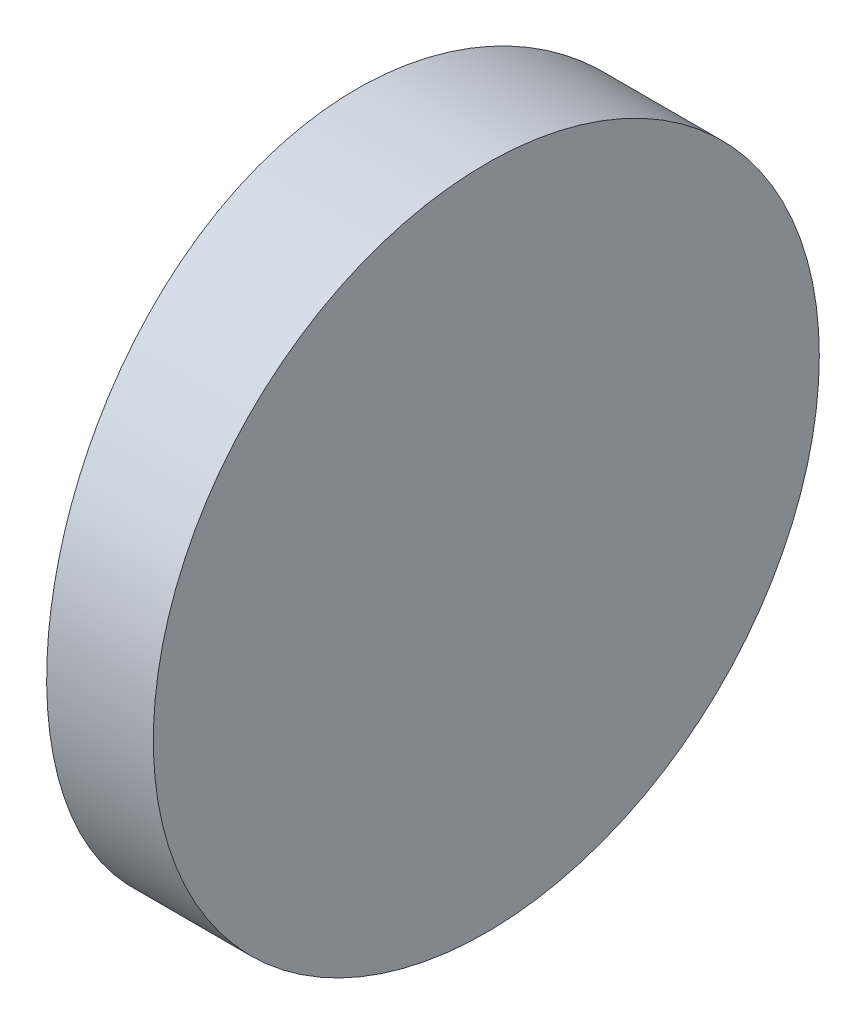
ISO-10303-21;
HEADER;
FILE_DESCRIPTION(('STEP AP214'),'2;1');
FILE_NAME('part.step','',(''),(''),'','','');
FILE_SCHEMA(('AUTOMOTIVE_DESIGN { 1 0 10303 214 1 1 1 1 }'));
ENDSEC;
DATA;
#1=APPLICATION_CONTEXT('core data for automotive mechanical design processes');
#2=APPLICATION_PROTOCOL_DEFINITION('international standard','automotive_design',2000,#1);
#3=PRODUCT_CONTEXT('',#1,'mechanical');
#4=PRODUCT('Part','Part','',(#3));
#5=PRODUCT_RELATED_PRODUCT_CATEGORY('part','',(#4));
#6=PRODUCT_DEFINITION_FORMATION('','',#4);
#7=PRODUCT_DEFINITION_CONTEXT('part definition',#1,'design');
#8=PRODUCT_DEFINITION('design','',#6,#7);
#9=PRODUCT_DEFINITION_SHAPE('','',#8);
#10=(LENGTH_UNIT() NAMED_UNIT(*) SI_UNIT(.MILLI.,.METRE.));
#11=(NAMED_UNIT(*) PLANE_ANGLE_UNIT() SI_UNIT($,.RADIAN.));
#12=(NAMED_UNIT(*) SI_UNIT($,.STERADIAN.) SOLID_ANGLE_UNIT());
#13=UNCERTAINTY_MEASURE_WITH_UNIT(LENGTH_MEASURE(1.E-05),#10,'distance_accuracy_value','');
#14=(GEOMETRIC_REPRESENTATION_CONTEXT(3) GLOBAL_UNCERTAINTY_ASSIGNED_CONTEXT((#13)) GLOBAL_UNIT_ASSIGNED_CONTEXT((#10,
#11,#12)) REPRESENTATION_CONTEXT('',''));
#15=CARTESIAN_POINT('',(0.,0.,0.));
#16=DIRECTION('',(0.,0.,1.));
#17=DIRECTION('',(1.,0.,0.));
#18=AXIS2_PLACEMENT_3D('',#15,#16,#17);
#19=CARTESIAN_POINT('',(4.35520433485127,12.5,0.));
#20=DIRECTION('',(0.,-1.,0.));
#21=DIRECTION('',(0.,0.,-1.));
#22=AXIS2_PLACEMENT_3D('',#19,#20,#21);
#23=CYLINDRICAL_SURFACE('',#22,45.85);
#24=CARTESIAN_POINT('',(-41.4947956651487,0.,0.));
#25=CARTESIAN_POINT('',(-41.494796367303,-1.93674694272046E-06,-0.1747178727447));
#26=CARTESIAN_POINT('',(-41.4937950063209,0.00732904198994089,-0.349407224060694));
#27=CARTESIAN_POINT('',(-41.4898189997994,0.036596356478098,-0.697591112908524));
#28=CARTESIAN_POINT('',(-41.4868438983899,0.0585360663774195,-0.871085365055477));
#29=CARTESIAN_POINT('',(-41.478999955798,0.116883746604013,-1.21571199890521));
#30=CARTESIAN_POINT('',(-41.4741296703258,0.153302751833956,-1.38684247597065));
#31=CARTESIAN_POINT('',(-41.4626306925045,0.240352148315136,-1.72545704793697));
#32=CARTESIAN_POINT('',(-41.4560013544731,0.290987758346605,-1.89293977941038));
#33=CARTESIAN_POINT('',(-41.4411794133805,0.406027764399685,-2.22282958540489));
#34=CARTESIAN_POINT('',(-41.4329885245475,0.470417071232602,-2.38524200055033));
#35=CARTESIAN_POINT('',(-41.4152644294861,0.612555367811835,-2.70410782793287));
#36=CARTESIAN_POINT('',(-41.4057307221772,0.690309347060316,-2.86055898787752));
#37=CARTESIAN_POINT('',(-41.3855954504674,0.858550111636787,-3.16625782169337));
#38=CARTESIAN_POINT('',(-41.37499455522,0.949028932130036,-3.31550992377015));
#39=CARTESIAN_POINT('',(-41.3530095665304,1.14216067387877,-3.60595424131082));
#40=CARTESIAN_POINT('',(-41.3416251190555,1.24481911361858,-3.74714275998305));
#41=CARTESIAN_POINT('',(-41.3183270102139,1.46218171009515,-4.02120121583313));
#42=CARTESIAN_POINT('',(-41.3064106932187,1.57695143692226,-4.1540189262156));
#43=CARTESIAN_POINT('',(-41.2824503115243,1.81719093773777,-4.40947083631157));
#44=CARTESIAN_POINT('',(-41.2704063062138,1.94265591332643,-4.5321095545718));
#45=CARTESIAN_POINT('',(-41.2465158434475,2.20354923589323,-4.76649849207292));
#46=CARTESIAN_POINT('',(-41.2346695270492,2.3389843528373,-4.87824119071149));
#47=CARTESIAN_POINT('',(-41.2115220318308,2.61875038815319,-5.08991986170299));
#48=CARTESIAN_POINT('',(-41.2002206506366,2.76307795804029,-5.18986023741302));
#49=CARTESIAN_POINT('',(-41.1784261242968,3.06039433230318,-5.37773071117889));
#50=CARTESIAN_POINT('',(-41.1679371659925,3.21342175710382,-5.46560019355556));
#51=CARTESIAN_POINT('',(-41.1481345482827,3.52635853386648,-5.62808579924972));
#52=CARTESIAN_POINT('',(-41.1388204564502,3.68626532454328,-5.70270680301116));
#53=CARTESIAN_POINT('',(-41.1216399341265,4.01175408233806,-5.83813295893073));
#54=CARTESIAN_POINT('',(-41.1137723382965,4.17733135243605,-5.89894924192032));
#55=CARTESIAN_POINT('',(-41.0997061359013,4.51304224235372,-6.00637505645227));
#56=CARTESIAN_POINT('',(-41.0935071250628,4.68317474750461,-6.05298802960742));
#57=CARTESIAN_POINT('',(-41.0812204232759,5.0834856504024,-6.1446433404619));
#58=CARTESIAN_POINT('',(-41.0758418946998,5.31498461067557,-6.18411157029543));
#59=CARTESIAN_POINT('',(-41.0686405642769,5.78100618907649,-6.2367884842759));
#60=CARTESIAN_POINT('',(-41.0668177312292,6.01552878065406,-6.24999739884517));
#61=CARTESIAN_POINT('',(-41.066816029764,6.424709395363,-6.25000193817468));
#62=CARTESIAN_POINT('',(-41.0678268081497,6.59939026860161,-6.2426716639464));
#63=CARTESIAN_POINT('',(-41.0718393627146,6.94755697234345,-6.2134072323685));
#64=CARTESIAN_POINT('',(-41.0748415990042,7.12104251731432,-6.19146970012386));
#65=CARTESIAN_POINT('',(-41.0827545077438,7.46565153887426,-6.13312797851577));
#66=CARTESIAN_POINT('',(-41.0876666373182,7.63677310843257,-6.09671274312613));
#67=CARTESIAN_POINT('',(-41.0992592673195,7.97536967745321,-6.00967264985825));
#68=CARTESIAN_POINT('',(-41.1059404172979,8.14284331296593,-5.95904257213971));
#69=CARTESIAN_POINT('',(-41.1208699716529,8.47271377511224,-5.84401592512814));
#70=CARTESIAN_POINT('',(-41.129116644458,8.63511598212691,-5.7796345559185));
#71=CARTESIAN_POINT('',(-41.1469501504565,8.95396227197784,-5.63751406043497));
#72=CARTESIAN_POINT('',(-41.156537483955,9.11040410267266,-5.55976994498607));
#73=CARTESIAN_POINT('',(-41.1767718192759,9.41608594548038,-5.39155041883195));
#74=CARTESIAN_POINT('',(-41.1874181578174,9.56533037959479,-5.30108296255366));
#75=CARTESIAN_POINT('',(-41.2094808510684,9.85576147414858,-5.10797499475481));
#76=CARTESIAN_POINT('',(-41.2208975538347,9.99694443844282,-5.00532896475663));
#77=CARTESIAN_POINT('',(-41.2442449067814,10.2710105432573,-4.78797877252988));
#78=CARTESIAN_POINT('',(-41.2561781696855,10.4038403808303,-4.67320767322604));
#79=CARTESIAN_POINT('',(-41.2801536944414,10.659316633154,-4.43296286985779));
#80=CARTESIAN_POINT('',(-41.2921959052634,10.781967566869,-4.30749396582788));
#81=CARTESIAN_POINT('',(-41.3160642463055,11.0163804200291,-4.04659034835777));
#82=CARTESIAN_POINT('',(-41.3278902231133,11.1281348349952,-3.91114887788189));
#83=CARTESIAN_POINT('',(-41.3509808000624,11.3398360106894,-3.63136775940348));
#84=CARTESIAN_POINT('',(-41.3622456087442,11.4397871769355,-3.48703146216917));
#85=CARTESIAN_POINT('',(-41.3839537265105,11.6276698496838,-3.18970821228421));
#86=CARTESIAN_POINT('',(-41.3943928638321,11.7155417914856,-3.03668330433088));
#87=CARTESIAN_POINT('',(-41.4140893711038,11.8780325834838,-2.72375136592458));
#88=CARTESIAN_POINT('',(-41.4233471758555,11.9526563138021,-2.56384689671031));
#89=CARTESIAN_POINT('',(-41.4404150874356,12.0880881116469,-2.23836281696949));
#90=CARTESIAN_POINT('',(-41.4482263578957,12.1489072928955,-2.07278789608683));
#91=CARTESIAN_POINT('',(-41.4621862404781,12.2563390229067,-1.73708220101255));
#92=CARTESIAN_POINT('',(-41.4683352549984,12.3029550103166,-1.56695254040891));
#93=CARTESIAN_POINT('',(-41.4805203848194,12.3946235822962,-1.16662311851959));
#94=CARTESIAN_POINT('',(-41.4858516151499,12.4340992602346,-0.935102336429318));
#95=CARTESIAN_POINT('',(-41.4929887691557,12.4867860578782,-0.469037227260577));
#96=CARTESIAN_POINT('',(-41.4947947227711,12.4999974006468,-0.234492925877932));
#97=CARTESIAN_POINT('',(-41.494796367303,12.5000019367469,0.174717872744736));
#98=CARTESIAN_POINT('',(-41.4937950063209,12.4926709580101,0.349407224060729));
#99=CARTESIAN_POINT('',(-41.4898189997994,12.4634036435219,0.69759111290856));
#100=CARTESIAN_POINT('',(-41.4868438983899,12.4414639336226,0.871085365055513));
#101=CARTESIAN_POINT('',(-41.478999955798,12.383116253396,1.21571199890525));
#102=CARTESIAN_POINT('',(-41.4741296703258,12.346697248166,1.38684247597069));
#103=CARTESIAN_POINT('',(-41.4626306925045,12.2596478516849,1.72545704793701));
#104=CARTESIAN_POINT('',(-41.4560013544731,12.2090122416534,1.89293977941041));
#105=CARTESIAN_POINT('',(-41.4411794133805,12.0939722356003,2.22282958540493));
#106=CARTESIAN_POINT('',(-41.4329885245475,12.0295829287674,2.38524200055037));
#107=CARTESIAN_POINT('',(-41.4152644294861,11.8874446321882,2.7041078279329));
#108=CARTESIAN_POINT('',(-41.4057307221772,11.8096906529397,2.86055898787755));
#109=CARTESIAN_POINT('',(-41.3855954504674,11.6414498883632,3.1662578216934));
#110=CARTESIAN_POINT('',(-41.37499455522,11.55097106787,3.31550992377019));
#111=CARTESIAN_POINT('',(-41.3530095665304,11.3578393261212,3.60595424131085));
#112=CARTESIAN_POINT('',(-41.3416251190555,11.2551808863814,3.74714275998308));
#113=CARTESIAN_POINT('',(-41.3183270102139,11.0378182899048,4.02120121583316));
#114=CARTESIAN_POINT('',(-41.3064106932187,10.9230485630777,4.15401892621563));
#115=CARTESIAN_POINT('',(-41.2824503115243,10.6828090622622,4.4094708363116));
#116=CARTESIAN_POINT('',(-41.2704063062138,10.5573440866736,4.53210955457183));
#117=CARTESIAN_POINT('',(-41.2465158434475,10.2964507641068,4.76649849207295));
#118=CARTESIAN_POINT('',(-41.2346695270492,10.1610156471627,4.87824119071153));
#119=CARTESIAN_POINT('',(-41.2115220318308,9.88124961184681,5.08991986170303));
#120=CARTESIAN_POINT('',(-41.2002206506366,9.73692204195972,5.18986023741306));
#121=CARTESIAN_POINT('',(-41.1784261242968,9.43960566769683,5.37773071117893));
#122=CARTESIAN_POINT('',(-41.1679371659925,9.28657824289618,5.4656001935556));
#123=CARTESIAN_POINT('',(-41.1481345482826,8.97364146613352,5.62808579924975));
#124=CARTESIAN_POINT('',(-41.1388204564502,8.81373467545673,5.7027068030112));
#125=CARTESIAN_POINT('',(-41.1216399341265,8.48824591766195,5.83813295893076));
#126=CARTESIAN_POINT('',(-41.1137723382965,8.32266864756395,5.89894924192036));
#127=CARTESIAN_POINT('',(-41.0997061359013,7.98695775764629,6.0063750564523));
#128=CARTESIAN_POINT('',(-41.0935071250628,7.81682525249539,6.05298802960745));
#129=CARTESIAN_POINT('',(-41.0812204232759,7.4165143495976,6.14464334046194));
#130=CARTESIAN_POINT('',(-41.0758418946998,7.18501538932443,6.18411157029546));
#131=CARTESIAN_POINT('',(-41.0686405642769,6.71899381092351,6.23678848427594));
#132=CARTESIAN_POINT('',(-41.0668177312292,6.48447121934594,6.2499973988452));
#133=CARTESIAN_POINT('',(-41.066816029764,6.075290604637,6.25000193817472));
#134=CARTESIAN_POINT('',(-41.0678268081497,5.90060973139839,6.24267166394644));
#135=CARTESIAN_POINT('',(-41.0718393627145,5.55244302765655,6.21340723236854));
#136=CARTESIAN_POINT('',(-41.0748415990042,5.37895748268568,6.19146970012389));
#137=CARTESIAN_POINT('',(-41.0827545077438,5.03434846112574,6.1331279785158));
#138=CARTESIAN_POINT('',(-41.0876666373182,4.86322689156743,6.09671274312616));
#139=CARTESIAN_POINT('',(-41.0992592673195,4.52463032254679,6.00967264985828));
#140=CARTESIAN_POINT('',(-41.1059404172979,4.35715668703407,5.95904257213974));
#141=CARTESIAN_POINT('',(-41.1208699716529,4.02728622488776,5.84401592512817));
#142=CARTESIAN_POINT('',(-41.129116644458,3.86488401787309,5.77963455591853));
#143=CARTESIAN_POINT('',(-41.1469501504565,3.54603772802216,5.63751406043501));
#144=CARTESIAN_POINT('',(-41.1565374839549,3.38959589732734,5.5597699449861));
#145=CARTESIAN_POINT('',(-41.1767718192759,3.08391405451962,5.39155041883199));
#146=CARTESIAN_POINT('',(-41.1874181578174,2.93466962040522,5.30108296255369));
#147=CARTESIAN_POINT('',(-41.2094808510684,2.64423852585143,5.10797499475484));
#148=CARTESIAN_POINT('',(-41.2208975538347,2.50305556155718,5.00532896475667));
#149=CARTESIAN_POINT('',(-41.2442449067813,2.22898945674273,4.78797877252991));
#150=CARTESIAN_POINT('',(-41.2561781696855,2.0961596191697,4.67320767322608));
#151=CARTESIAN_POINT('',(-41.2801536944414,1.84068336684602,4.43296286985782));
#152=CARTESIAN_POINT('',(-41.2921959052633,1.71803243313104,4.30749396582792));
#153=CARTESIAN_POINT('',(-41.3160642463054,1.48361957997087,4.0465903483578));
#154=CARTESIAN_POINT('',(-41.3278902231133,1.37186516500482,3.91114887788193));
#155=CARTESIAN_POINT('',(-41.3509808000624,1.16016398931057,3.63136775940352));
#156=CARTESIAN_POINT('',(-41.3622456087442,1.06021282306451,3.4870314621692));
#157=CARTESIAN_POINT('',(-41.3839537265105,0.872330150316247,3.18970821228425));
#158=CARTESIAN_POINT('',(-41.3943928638321,0.784458208514423,3.03668330433091));
#159=CARTESIAN_POINT('',(-41.4140893711038,0.621967416516184,2.72375136592462));
#160=CARTESIAN_POINT('',(-41.4233471758555,0.547343686197883,2.56384689671035));
#161=CARTESIAN_POINT('',(-41.4404150874356,0.411911888353077,2.23836281696953));
#162=CARTESIAN_POINT('',(-41.4482263578957,0.351092707104501,2.07278789608687));
#163=CARTESIAN_POINT('',(-41.4621862404781,0.243660977093314,1.73708220101259));
#164=CARTESIAN_POINT('',(-41.4683352549984,0.197044989683407,1.56695254040894));
#165=CARTESIAN_POINT('',(-41.4805203848194,0.105376417703802,1.16662311851962));
#166=CARTESIAN_POINT('',(-41.4858516151499,0.0659007397653927,0.93510233642935));
#167=CARTESIAN_POINT('',(-41.4929887691557,0.0132139421217815,0.46903722726061));
#168=CARTESIAN_POINT('',(-41.4947947227711,2.59935317520296E-06,0.234492925877966));
#169=CARTESIAN_POINT('',(-41.4947956651487,0.,0.));
#170=B_SPLINE_CURVE_WITH_KNOTS('',3,(#24,#25,#26,#27,#28,#29,#30,#31,#32,#33,#34,#35,#36,#37,
#38,#39,#40,#41,#42,#43,#44,#45,#46,#47,#48,#49,#50,#51,#52,#53,#54,#55,#56,#57,#58,#59,#60,#61,
#62,#63,#64,#65,#66,#67,#68,#69,#70,#71,#72,#73,#74,#75,#76,#77,#78,#79,#80,#81,#82,#83,#84,#85,
#86,#87,#88,#89,#90,#91,#92,#93,#94,#95,#96,#97,#98,#99,#100,#101,#102,#103,#104,#105,#106,#107,
#108,#109,#110,#111,#112,#113,#114,#115,#116,#117,#118,#119,#120,#121,#122,#123,#124,#125,#126,
#127,#128,#129,#130,#131,#132,#133,#134,#135,#136,#137,#138,#139,#140,#141,#142,#143,#144,#145,
#146,#147,#148,#149,#150,#151,#152,#153,#154,#155,#156,#157,#158,#159,#160,#161,#162,#163,#164,
#165,#166,#167,#168,#169),.UNSPECIFIED.,.T.,.F.,(4,2,2,2,2,2,2,2,2,2,2,2,2,2,2,2,2,2,2,2,2,2,2,
2,2,2,2,2,2,2,2,2,2,2,2,2,2,2,2,2,2,2,2,2,2,2,2,2,2,2,2,2,2,2,2,2,2,2,2,2,2,2,2,2,2,2,2,2,2,2,2,
2,4),(0.,0.523948033545814,1.04801712426815,1.57248638440812,2.09714842451125,2.62123778719269,
3.145523237537,3.66948197149458,4.19367902000679,4.72087579728761,5.2478372813541,
5.77515994542762,6.3022852436634,6.83196770815593,7.36145464275266,7.89051312013551,
8.4194432988991,9.12258717889429,9.82572488885973,10.3496474602852,10.8736911220272,
11.3981353820514,11.9227724759989,12.4468326324457,12.9710888810743,13.4950188182242,
14.0191870770443,14.5464173660619,15.0734123228523,15.6007676970264,16.1279256114766,
16.6575963114729,17.187071494873,17.7161188860755,18.2450380909276,18.9482469209525,
19.6514497785884,20.1753978121342,20.6994669028566,21.2239361629965,21.7485982030997,
22.2726875657811,22.7969730161254,23.320931750083,23.8451287985952,24.372325575876,
24.8992870599425,25.426609724016,25.9537350222518,26.4834174867444,27.0129044213411,
27.5419628987239,28.0708930774875,28.7740369574827,29.4771746674482,30.0010972388736,
30.5251409006156,31.0495851606398,31.5742222545873,32.0982824110341,32.6225386596628,
33.1464685968126,33.6706368556327,34.1978671446503,34.7248621014407,35.2522174756149,
35.779375390065,36.3090460900613,36.8385212734614,37.3675686646639,37.8964878695161,
38.599696699541,39.3028995571769),.UNSPECIFIED.);
#171=CARTESIAN_POINT('',(-41.4947956651487,0.,0.));
#172=VERTEX_POINT('',#171);
#173=EDGE_CURVE('E10',#172,#172,#170,.T.);
#174=ORIENTED_EDGE('',*,*,#173,.F.);
#175=EDGE_LOOP('',(#174));
#176=FACE_BOUND('',#175,.T.);
#177=ADVANCED_FACE('F35',(#176),#23,.T.);
#178=CARTESIAN_POINT('',(-39.0647956651487,12.5,-6.25));
#179=DIRECTION('',(1.,0.,0.));
#180=DIRECTION('',(0.,0.,-1.));
#181=AXIS2_PLACEMENT_3D('',#178,#179,#180);
#182=PLANE('',#181);
#183=CARTESIAN_POINT('',(-39.0647956651487,6.25,0.));
#184=DIRECTION('',(1.,0.,0.));
#185=DIRECTION('',(0.,0.,-1.));
#186=AXIS2_PLACEMENT_3D('',#183,#184,#185);
#187=CIRCLE('',#186,6.25);
#188=CARTESIAN_POINT('',(-39.0647956651487,6.25,-6.24999999999998));
#189=VERTEX_POINT('',#188);
#190=EDGE_CURVE('E45',#189,#189,#187,.T.);
#191=ORIENTED_EDGE('',*,*,#190,.T.);
#192=EDGE_LOOP('',(#191));
#193=FACE_BOUND('',#192,.T.);
#194=ADVANCED_FACE('F37',(#193),#182,.T.);
#195=CARTESIAN_POINT('',(-51.7647956651487,6.25,0.));
#196=DIRECTION('',(1.,0.,0.));
#197=DIRECTION('',(0.,0.,-1.));
#198=AXIS2_PLACEMENT_3D('',#195,#196,#197);
#199=CYLINDRICAL_SURFACE('',#198,6.25);
#200=ORIENTED_EDGE('',*,*,#190,.F.);
#201=EDGE_LOOP('',(#200));
#202=FACE_BOUND('',#201,.T.);
#203=ORIENTED_EDGE('',*,*,#173,.T.);
#204=EDGE_LOOP('',(#203));
#205=FACE_BOUND('',#204,.T.);
#206=ADVANCED_FACE('F52',(#202,#205),#199,.T.);
#207=CLOSED_SHELL('',(#177,#194,#206));
#208=MANIFOLD_SOLID_BREP('B2',#207);
#209=ADVANCED_BREP_SHAPE_REPRESENTATION('',(#18,#208),#14);
#210=SHAPE_DEFINITION_REPRESENTATION(#9,#209);
ENDSEC;
END-ISO-10303-21;
